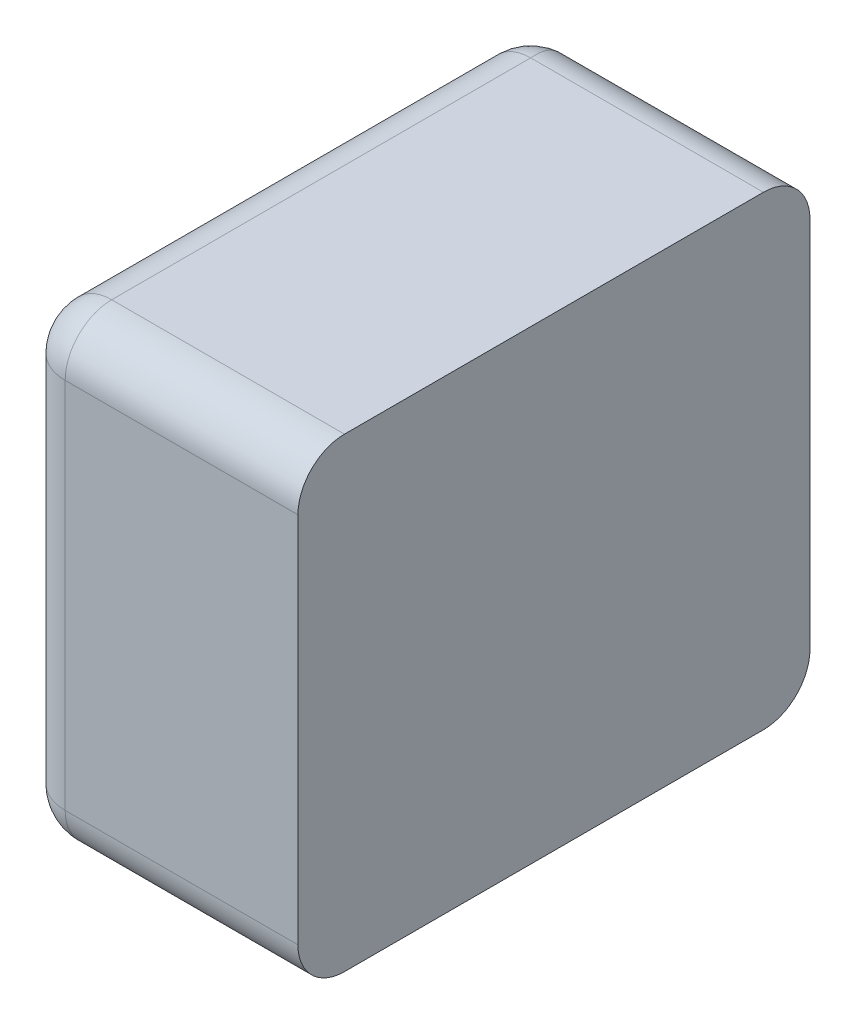
ISO-10303-21;
HEADER;
FILE_DESCRIPTION(('STEP AP214'),'2;1');
FILE_NAME('part.step','',(''),(''),'','','');
FILE_SCHEMA(('AUTOMOTIVE_DESIGN { 1 0 10303 214 1 1 1 1 }'));
ENDSEC;
DATA;
#1=APPLICATION_CONTEXT('core data for automotive mechanical design processes');
#2=APPLICATION_PROTOCOL_DEFINITION('international standard','automotive_design',2000,#1);
#3=PRODUCT_CONTEXT('',#1,'mechanical');
#4=PRODUCT('Part','Part','',(#3));
#5=PRODUCT_RELATED_PRODUCT_CATEGORY('part','',(#4));
#6=PRODUCT_DEFINITION_FORMATION('','',#4);
#7=PRODUCT_DEFINITION_CONTEXT('part definition',#1,'design');
#8=PRODUCT_DEFINITION('design','',#6,#7);
#9=PRODUCT_DEFINITION_SHAPE('','',#8);
#10=(LENGTH_UNIT() NAMED_UNIT(*) SI_UNIT(.MILLI.,.METRE.));
#11=(NAMED_UNIT(*) PLANE_ANGLE_UNIT() SI_UNIT($,.RADIAN.));
#12=(NAMED_UNIT(*) SI_UNIT($,.STERADIAN.) SOLID_ANGLE_UNIT());
#13=UNCERTAINTY_MEASURE_WITH_UNIT(LENGTH_MEASURE(1.E-05),#10,'distance_accuracy_value','');
#14=(GEOMETRIC_REPRESENTATION_CONTEXT(3) GLOBAL_UNCERTAINTY_ASSIGNED_CONTEXT((#13)) GLOBAL_UNIT_ASSIGNED_CONTEXT((#10,
#11,#12)) REPRESENTATION_CONTEXT('',''));
#15=CARTESIAN_POINT('',(0.,0.,0.));
#16=DIRECTION('',(0.,0.,1.));
#17=DIRECTION('',(1.,0.,0.));
#18=AXIS2_PLACEMENT_3D('',#15,#16,#17);
#19=CARTESIAN_POINT('',(-0.45,0.125,0.5));
#20=DIRECTION('',(0.,-1.,0.));
#21=DIRECTION('',(-0.707106781186548,0.,0.707106781186548));
#22=AXIS2_PLACEMENT_3D('',#19,#20,#21);
#23=CYLINDRICAL_SURFACE('',#22,0.05);
#24=CARTESIAN_POINT('',(-0.45,0.2,0.5));
#25=DIRECTION('',(0.,-1.,0.));
#26=DIRECTION('',(0.,0.,1.));
#27=AXIS2_PLACEMENT_3D('',#24,#25,#26);
#28=CIRCLE('',#27,0.05);
#29=CARTESIAN_POINT('',(-0.45,0.2,0.55));
#30=VERTEX_POINT('',#29);
#31=CARTESIAN_POINT('',(-0.5,0.2,0.5));
#32=VERTEX_POINT('',#31);
#33=EDGE_CURVE('E11',#30,#32,#28,.T.);
#34=ORIENTED_EDGE('',*,*,#33,.T.);
#35=DIRECTION('',(0.,-1.,0.));
#36=VECTOR('',#35,1.);
#37=CARTESIAN_POINT('',(-0.5,0.125,0.5));
#38=LINE('',#37,#36);
#39=CARTESIAN_POINT('',(-0.5,-0.2,0.5));
#40=VERTEX_POINT('',#39);
#41=EDGE_CURVE('E24',#32,#40,#38,.T.);
#42=ORIENTED_EDGE('',*,*,#41,.T.);
#43=CARTESIAN_POINT('',(-0.45,-0.2,0.5));
#44=DIRECTION('',(0.,1.,0.));
#45=DIRECTION('',(-1.,0.,0.));
#46=AXIS2_PLACEMENT_3D('',#43,#44,#45);
#47=CIRCLE('',#46,0.05);
#48=CARTESIAN_POINT('',(-0.45,-0.2,0.55));
#49=VERTEX_POINT('',#48);
#50=EDGE_CURVE('E273',#40,#49,#47,.T.);
#51=ORIENTED_EDGE('',*,*,#50,.T.);
#52=DIRECTION('',(0.,1.,0.));
#53=VECTOR('',#52,1.);
#54=CARTESIAN_POINT('',(-0.45,0.125,0.55));
#55=LINE('',#54,#53);
#56=EDGE_CURVE('E271',#49,#30,#55,.T.);
#57=ORIENTED_EDGE('',*,*,#56,.T.);
#58=EDGE_LOOP('',(#34,#42,#51,#57));
#59=FACE_BOUND('',#58,.T.);
#60=ADVANCED_FACE('F17',(#59),#23,.T.);
#61=CARTESIAN_POINT('',(-0.45,-0.2,0.));
#62=DIRECTION('',(0.,0.,1.));
#63=DIRECTION('',(-0.707106781186548,-0.707106781186548,0.));
#64=AXIS2_PLACEMENT_3D('',#61,#62,#63);
#65=CYLINDRICAL_SURFACE('',#64,0.05);
#66=CARTESIAN_POINT('',(-0.45,-0.2,0.05));
#67=DIRECTION('',(0.,0.,1.));
#68=DIRECTION('',(-1.,0.,0.));
#69=AXIS2_PLACEMENT_3D('',#66,#67,#68);
#70=CIRCLE('',#69,0.05);
#71=CARTESIAN_POINT('',(-0.5,-0.2,0.05));
#72=VERTEX_POINT('',#71);
#73=CARTESIAN_POINT('',(-0.45,-0.25,0.05));
#74=VERTEX_POINT('',#73);
#75=EDGE_CURVE('E269',#72,#74,#70,.T.);
#76=ORIENTED_EDGE('',*,*,#75,.T.);
#77=DIRECTION('',(0.,0.,1.));
#78=VECTOR('',#77,1.);
#79=CARTESIAN_POINT('',(-0.45,-0.25,0.));
#80=LINE('',#79,#78);
#81=CARTESIAN_POINT('',(-0.45,-0.25,0.5));
#82=VERTEX_POINT('',#81);
#83=EDGE_CURVE('E267',#74,#82,#80,.T.);
#84=ORIENTED_EDGE('',*,*,#83,.T.);
#85=CARTESIAN_POINT('',(-0.45,-0.2,0.5));
#86=DIRECTION('',(0.,0.,-1.));
#87=DIRECTION('',(0.,-1.,0.));
#88=AXIS2_PLACEMENT_3D('',#85,#86,#87);
#89=CIRCLE('',#88,0.05);
#90=EDGE_CURVE('E251',#82,#40,#89,.T.);
#91=ORIENTED_EDGE('',*,*,#90,.T.);
#92=DIRECTION('',(0.,0.,-1.));
#93=VECTOR('',#92,1.);
#94=CARTESIAN_POINT('',(-0.5,-0.2,0.));
#95=LINE('',#94,#93);
#96=EDGE_CURVE('E239',#40,#72,#95,.T.);
#97=ORIENTED_EDGE('',*,*,#96,.T.);
#98=EDGE_LOOP('',(#76,#84,#91,#97));
#99=FACE_BOUND('',#98,.T.);
#100=ADVANCED_FACE('F231',(#99),#65,.T.);
#101=CARTESIAN_POINT('',(-0.45,-0.2,0.5));
#102=DIRECTION('',(0.408248290463863,-0.816496580927726,-0.408248290463863));
#103=DIRECTION('',(-0.577350269189625,-0.577350269189626,0.577350269189626));
#104=AXIS2_PLACEMENT_3D('',#101,#102,#103);
#105=SPHERICAL_SURFACE('',#104,0.05);
#106=ORIENTED_EDGE('',*,*,#90,.F.);
#107=CARTESIAN_POINT('',(-0.45,-0.2,0.5));
#108=DIRECTION('',(-1.,0.,0.));
#109=DIRECTION('',(0.,-0.707106781186547,0.707106781186548));
#110=AXIS2_PLACEMENT_3D('',#107,#108,#109);
#111=CIRCLE('',#110,0.05);
#112=EDGE_CURVE('E283',#82,#49,#111,.T.);
#113=ORIENTED_EDGE('',*,*,#112,.T.);
#114=ORIENTED_EDGE('',*,*,#50,.F.);
#115=EDGE_LOOP('',(#106,#113,#114));
#116=FACE_BOUND('',#115,.T.);
#117=ADVANCED_FACE('F227',(#116),#105,.T.);
#118=CARTESIAN_POINT('',(-0.45,0.125,0.05));
#119=DIRECTION('',(0.,-1.,0.));
#120=DIRECTION('',(-0.707106781186548,0.,-0.707106781186547));
#121=AXIS2_PLACEMENT_3D('',#118,#119,#120);
#122=CYLINDRICAL_SURFACE('',#121,0.05);
#123=CARTESIAN_POINT('',(-0.45,0.2,0.05));
#124=DIRECTION('',(0.,-1.,0.));
#125=DIRECTION('',(-1.,0.,0.));
#126=AXIS2_PLACEMENT_3D('',#123,#124,#125);
#127=CIRCLE('',#126,0.05);
#128=CARTESIAN_POINT('',(-0.5,0.2,0.05));
#129=VERTEX_POINT('',#128);
#130=CARTESIAN_POINT('',(-0.45,0.2,0.));
#131=VERTEX_POINT('',#130);
#132=EDGE_CURVE('E286',#129,#131,#127,.T.);
#133=ORIENTED_EDGE('',*,*,#132,.T.);
#134=DIRECTION('',(0.,-1.,0.));
#135=VECTOR('',#134,1.);
#136=CARTESIAN_POINT('',(-0.45,0.125,0.));
#137=LINE('',#136,#135);
#138=CARTESIAN_POINT('',(-0.45,-0.2,0.));
#139=VERTEX_POINT('',#138);
#140=EDGE_CURVE('E301',#131,#139,#137,.T.);
#141=ORIENTED_EDGE('',*,*,#140,.T.);
#142=CARTESIAN_POINT('',(-0.45,-0.2,0.05));
#143=DIRECTION('',(0.,1.,0.));
#144=DIRECTION('',(0.,0.,-1.));
#145=AXIS2_PLACEMENT_3D('',#142,#143,#144);
#146=CIRCLE('',#145,0.05);
#147=EDGE_CURVE('E329',#139,#72,#146,.T.);
#148=ORIENTED_EDGE('',*,*,#147,.T.);
#149=DIRECTION('',(0.,1.,0.));
#150=VECTOR('',#149,1.);
#151=CARTESIAN_POINT('',(-0.5,0.125,0.05));
#152=LINE('',#151,#150);
#153=EDGE_CURVE('E322',#72,#129,#152,.T.);
#154=ORIENTED_EDGE('',*,*,#153,.T.);
#155=EDGE_LOOP('',(#133,#141,#148,#154));
#156=FACE_BOUND('',#155,.T.);
#157=ADVANCED_FACE('F223',(#156),#122,.T.);
#158=CARTESIAN_POINT('',(-0.45,-0.2,0.05));
#159=DIRECTION('',(0.408248290463863,0.408248290463863,-0.816496580927726));
#160=DIRECTION('',(-0.577350269189626,-0.577350269189625,-0.577350269189626));
#161=AXIS2_PLACEMENT_3D('',#158,#159,#160);
#162=SPHERICAL_SURFACE('',#161,0.05);
#163=ORIENTED_EDGE('',*,*,#147,.F.);
#164=CARTESIAN_POINT('',(-0.45,-0.2,0.05));
#165=DIRECTION('',(-1.,0.,0.));
#166=DIRECTION('',(0.,-0.707106781186547,-0.707106781186548));
#167=AXIS2_PLACEMENT_3D('',#164,#165,#166);
#168=CIRCLE('',#167,0.05);
#169=EDGE_CURVE('E297',#139,#74,#168,.T.);
#170=ORIENTED_EDGE('',*,*,#169,.T.);
#171=ORIENTED_EDGE('',*,*,#75,.F.);
#172=EDGE_LOOP('',(#163,#170,#171));
#173=FACE_BOUND('',#172,.T.);
#174=ADVANCED_FACE('F219',(#173),#162,.T.);
#175=CARTESIAN_POINT('',(-0.45,0.2,0.));
#176=DIRECTION('',(0.,0.,1.));
#177=DIRECTION('',(-0.707106781186548,0.707106781186548,0.));
#178=AXIS2_PLACEMENT_3D('',#175,#176,#177);
#179=CYLINDRICAL_SURFACE('',#178,0.05);
#180=CARTESIAN_POINT('',(-0.45,0.2,0.05));
#181=DIRECTION('',(0.,0.,1.));
#182=DIRECTION('',(0.,1.,0.));
#183=AXIS2_PLACEMENT_3D('',#180,#181,#182);
#184=CIRCLE('',#183,0.05);
#185=CARTESIAN_POINT('',(-0.45,0.25,0.05));
#186=VERTEX_POINT('',#185);
#187=EDGE_CURVE('E312',#186,#129,#184,.T.);
#188=ORIENTED_EDGE('',*,*,#187,.T.);
#189=DIRECTION('',(0.,0.,1.));
#190=VECTOR('',#189,1.);
#191=CARTESIAN_POINT('',(-0.5,0.2,0.));
#192=LINE('',#191,#190);
#193=EDGE_CURVE('E308',#129,#32,#192,.T.);
#194=ORIENTED_EDGE('',*,*,#193,.T.);
#195=CARTESIAN_POINT('',(-0.45,0.2,0.5));
#196=DIRECTION('',(0.,0.,-1.));
#197=DIRECTION('',(-1.,0.,0.));
#198=AXIS2_PLACEMENT_3D('',#195,#196,#197);
#199=CIRCLE('',#198,0.05);
#200=CARTESIAN_POINT('',(-0.45,0.25,0.5));
#201=VERTEX_POINT('',#200);
#202=EDGE_CURVE('E205',#32,#201,#199,.T.);
#203=ORIENTED_EDGE('',*,*,#202,.T.);
#204=DIRECTION('',(0.,0.,-1.));
#205=VECTOR('',#204,1.);
#206=CARTESIAN_POINT('',(-0.45,0.25,0.));
#207=LINE('',#206,#205);
#208=EDGE_CURVE('E197',#201,#186,#207,.T.);
#209=ORIENTED_EDGE('',*,*,#208,.T.);
#210=EDGE_LOOP('',(#188,#194,#203,#209));
#211=FACE_BOUND('',#210,.T.);
#212=ADVANCED_FACE('F210',(#211),#179,.T.);
#213=CARTESIAN_POINT('',(-0.45,0.2,0.05));
#214=DIRECTION('',(0.408248290463863,-0.408248290463863,-0.816496580927726));
#215=DIRECTION('',(-0.577350269189626,0.577350269189626,-0.577350269189626));
#216=AXIS2_PLACEMENT_3D('',#213,#214,#215);
#217=SPHERICAL_SURFACE('',#216,0.05);
#218=ORIENTED_EDGE('',*,*,#187,.F.);
#219=CARTESIAN_POINT('',(-0.45,0.25,0.0500000000000001));
#220=CARTESIAN_POINT('',(-0.450056476640882,0.250000020313967,0.0491686475723329));
#221=CARTESIAN_POINT('',(-0.450121168311557,0.249979171317549,0.0483378888751717));
#222=CARTESIAN_POINT('',(-0.450265391195623,0.249895695565037,0.0466759757512485));
#223=CARTESIAN_POINT('',(-0.450344988001439,0.249832880868058,0.0458448364284618));
#224=CARTESIAN_POINT('',(-0.450517234671643,0.249665097579262,0.0441847638939235));
#225=CARTESIAN_POINT('',(-0.450609936033336,0.249559959502558,0.0433558532050473));
#226=CARTESIAN_POINT('',(-0.450806520816706,0.249307372398355,0.0417027833546375));
#227=CARTESIAN_POINT('',(-0.45091044290025,0.249159773963409,0.0408786516427795));
#228=CARTESIAN_POINT('',(-0.451127528752862,0.248822292392348,0.0392376527508478));
#229=CARTESIAN_POINT('',(-0.451240719867609,0.248632281058567,0.0384208155731756));
#230=CARTESIAN_POINT('',(-0.451474344176626,0.248210195281024,0.0367968679832575));
#231=CARTESIAN_POINT('',(-0.451594795122853,0.247978014684369,0.0359897877288635));
#232=CARTESIAN_POINT('',(-0.451840892195575,0.247472005262752,0.0343877588325528));
#233=CARTESIAN_POINT('',(-0.451966548375925,0.247198092814035,0.0335928381568206));
#234=CARTESIAN_POINT('',(-0.452220973549075,0.246609228401466,0.0320174664661125));
#235=CARTESIAN_POINT('',(-0.452349746928956,0.24629421548598,0.0312370389478302));
#236=CARTESIAN_POINT('',(-0.452608300810853,0.24562395131688,0.0296929165821987));
#237=CARTESIAN_POINT('',(-0.452738082163722,0.245268661584212,0.0289292385821268));
#238=CARTESIAN_POINT('',(-0.452996535248399,0.244518835357465,0.0274207951382167));
#239=CARTESIAN_POINT('',(-0.453125206487437,0.244124282319878,0.0266760378338959));
#240=CARTESIAN_POINT('',(-0.453379323912972,0.243297108379355,0.0252075249279587));
#241=CARTESIAN_POINT('',(-0.453504770480528,0.242864492001337,0.0244837668435499));
#242=CARTESIAN_POINT('',(-0.453750336828149,0.241962553597264,0.0230592436005362));
#243=CARTESIAN_POINT('',(-0.453870460068205,0.241493255977843,0.0223584635863285));
#244=CARTESIAN_POINT('',(-0.454103304064891,0.240519495705679,0.0209817830794971));
#245=CARTESIAN_POINT('',(-0.454216033516177,0.240015075848481,0.020305853790615));
#246=CARTESIAN_POINT('',(-0.454432052512974,0.238972784289588,0.0189806505019824));
#247=CARTESIAN_POINT('',(-0.454535358057478,0.238434971990044,0.0183313323972142));
#248=CARTESIAN_POINT('',(-0.454730542154479,0.237327774609329,0.0170610107449638));
#249=CARTESIAN_POINT('',(-0.454822445957708,0.236758463484927,0.0164399466310213));
#250=CARTESIAN_POINT('',(-0.454992901649071,0.235590305843476,0.0152276706097986));
#251=CARTESIAN_POINT('',(-0.455071489829275,0.23499154553938,0.0146363807516999));
#252=CARTESIAN_POINT('',(-0.455213463043959,0.233766676890247,0.0134850647248488));
#253=CARTESIAN_POINT('',(-0.455276897009026,0.233140664496341,0.012924942540811));
#254=CARTESIAN_POINT('',(-0.455386795425953,0.231863619839021,0.011837243218224));
#255=CARTESIAN_POINT('',(-0.455433322818258,0.231212690558093,0.0113095515743238));
#256=CARTESIAN_POINT('',(-0.455507737338678,0.229888271236327,0.0102878612038457));
#257=CARTESIAN_POINT('',(-0.45553570253075,0.229214888348585,0.00979372932103676));
#258=CARTESIAN_POINT('',(-0.455571427793508,0.227848141278855,0.00884017011466115));
#259=CARTESIAN_POINT('',(-0.455579281877824,0.227154885445235,0.00838059109664291));
#260=CARTESIAN_POINT('',(-0.455573335713261,0.225751081087255,0.00749701090952373));
#261=CARTESIAN_POINT('',(-0.455559645939104,0.225040639060477,0.00707283990073674));
#262=CARTESIAN_POINT('',(-0.455509287643763,0.223605248184243,0.0062608091643944));
#263=CARTESIAN_POINT('',(-0.455472746231199,0.222880400913832,0.00587276212999637));
#264=CARTESIAN_POINT('',(-0.455375493621831,0.221419070457526,0.00513357207398296));
#265=CARTESIAN_POINT('',(-0.455314925981526,0.220682680895238,0.00478222524352162));
#266=CARTESIAN_POINT('',(-0.455168570932992,0.219201208347948,0.00411688728920321));
#267=CARTESIAN_POINT('',(-0.455082942970717,0.218456208087868,0.00380267710656442));
#268=CARTESIAN_POINT('',(-0.454885566112575,0.216960517038454,0.00321192384506902));
#269=CARTESIAN_POINT('',(-0.454773991607376,0.216209895271862,0.00293514798912296));
#270=CARTESIAN_POINT('',(-0.454523973299393,0.214706002926951,0.00241943417305823));
#271=CARTESIAN_POINT('',(-0.454385717519098,0.213952785138196,0.00218025153084975));
#272=CARTESIAN_POINT('',(-0.454081755398417,0.212446796385434,0.00173976080825311));
#273=CARTESIAN_POINT('',(-0.453916248962334,0.211694059537445,0.00153819817979118));
#274=CARTESIAN_POINT('',(-0.453557343726359,0.210192060427522,0.00117283430568305));
#275=CARTESIAN_POINT('',(-0.453364154831346,0.209442812292273,0.00100877105149765));
#276=CARTESIAN_POINT('',(-0.453052732369609,0.208321945507501,0.000790441264630339));
#277=CARTESIAN_POINT('',(-0.452945638881777,0.207949832604319,0.000722439845056718));
#278=CARTESIAN_POINT('',(-0.452724431166697,0.207207637428366,0.000595741109099705));
#279=CARTESIAN_POINT('',(-0.452610344441124,0.206837552741953,0.000537010232220855));
#280=CARTESIAN_POINT('',(-0.452375149481327,0.206099812695661,0.000428806639232069));
#281=CARTESIAN_POINT('',(-0.452254068989278,0.205732153421865,0.00037930024688638));
#282=CARTESIAN_POINT('',(-0.452004892004011,0.204999641822439,0.000289487013903615));
#283=CARTESIAN_POINT('',(-0.451876823418455,0.204634784141684,0.000249146488184946));
#284=CARTESIAN_POINT('',(-0.45161368768569,0.203908256305697,0.000177600103776418));
#285=CARTESIAN_POINT('',(-0.451478648512781,0.203546579332125,0.0001463606364773));
#286=CARTESIAN_POINT('',(-0.451201599789781,0.20282678964261,9.2943500749361E-05));
#287=CARTESIAN_POINT('',(-0.451059618183824,0.202468668656838,7.07323935902586E-05));
#288=CARTESIAN_POINT('',(-0.450768722771826,0.201756364451594,3.52924790904308E-05));
#289=CARTESIAN_POINT('',(-0.450619836783965,0.201402171529021,2.20304925721484E-05));
#290=CARTESIAN_POINT('',(-0.450315184973883,0.200698095332166,4.39992448218605E-06));
#291=CARTESIAN_POINT('',(-0.45015944673132,0.200348200942932,-1.47590172806037E-09));
#292=CARTESIAN_POINT('',(-0.45,0.2,0.));
#293=B_SPLINE_CURVE_WITH_KNOTS('',3,(#219,#220,#221,#222,#223,#224,#225,#226,#227,#228,#229,
#230,#231,#232,#233,#234,#235,#236,#237,#238,#239,#240,#241,#242,#243,#244,#245,#246,#247,#248,
#249,#250,#251,#252,#253,#254,#255,#256,#257,#258,#259,#260,#261,#262,#263,#264,#265,#266,#267,
#268,#269,#270,#271,#272,#273,#274,#275,#276,#277,#278,#279,#280,#281,#282,#283,#284,#285,#286,
#287,#288,#289,#290,#291,#292),.UNSPECIFIED.,.F.,.F.,(4,2,2,2,2,2,2,2,2,2,2,2,2,2,2,2,2,2,2,2,2,
2,2,2,2,2,2,2,2,2,2,2,2,2,2,2,4),(0.,0.00249945349828856,0.00501017636236175,
0.00753105510997416,0.0100609150362242,0.0125985278601289,0.015142619470862,0.017691877752768,
0.020244960471291,0.0228005032044077,0.0253571273060391,0.0279134478892867,0.0304680818182009,
0.0330196556971653,0.0355668138468768,0.0381082262553105,0.0406425964909795,0.0431686695642027,
0.0456852397199664,0.048191158143267,0.0506853405545279,0.0531667746687543,0.0556345274875088,
0.0580877523875284,0.0605256959638785,0.0629477045789643,0.0653532305615733,0.0677418379925143,
0.0701132080055177,0.0712924926926685,0.0724674051483096,0.0736379404537152,0.0748041017706804,
0.0759659004268235,0.0771233559869031,0.0782764963093342,0.0794253575870824),.UNSPECIFIED.);
#294=EDGE_CURVE('E157',#186,#131,#293,.T.);
#295=ORIENTED_EDGE('',*,*,#294,.T.);
#296=ORIENTED_EDGE('',*,*,#132,.F.);
#297=EDGE_LOOP('',(#218,#295,#296));
#298=FACE_BOUND('',#297,.T.);
#299=ADVANCED_FACE('F189',(#298),#217,.T.);
#300=CARTESIAN_POINT('',(-0.45,0.2,0.5));
#301=DIRECTION('',(-0.408248290463863,-0.816496580927727,0.408248290463862));
#302=DIRECTION('',(-0.577350269189626,0.577350269189625,0.577350269189627));
#303=AXIS2_PLACEMENT_3D('',#300,#301,#302);
#304=SPHERICAL_SURFACE('',#303,0.05);
#305=ORIENTED_EDGE('',*,*,#33,.F.);
#306=CARTESIAN_POINT('',(-0.45,0.2,0.5));
#307=DIRECTION('',(-1.,0.,0.));
#308=DIRECTION('',(0.,0.707106781186547,0.707106781186548));
#309=AXIS2_PLACEMENT_3D('',#306,#307,#308);
#310=CIRCLE('',#309,0.05);
#311=EDGE_CURVE('E96',#30,#201,#310,.T.);
#312=ORIENTED_EDGE('',*,*,#311,.T.);
#313=ORIENTED_EDGE('',*,*,#202,.F.);
#314=EDGE_LOOP('',(#305,#312,#313));
#315=FACE_BOUND('',#314,.T.);
#316=ADVANCED_FACE('F184',(#315),#304,.T.);
#317=CARTESIAN_POINT('',(-0.425,-0.2,0.05));
#318=DIRECTION('',(1.,0.,0.));
#319=DIRECTION('',(0.,-0.707106781186547,-0.707106781186548));
#320=AXIS2_PLACEMENT_3D('',#317,#318,#319);
#321=CYLINDRICAL_SURFACE('',#320,0.05);
#322=ORIENTED_EDGE('',*,*,#169,.F.);
#323=DIRECTION('',(1.,0.,0.));
#324=VECTOR('',#323,1.);
#325=CARTESIAN_POINT('',(-0.425,-0.2,0.));
#326=LINE('',#325,#324);
#327=CARTESIAN_POINT('',(-0.2,-0.2,0.));
#328=VERTEX_POINT('',#327);
#329=EDGE_CURVE('E152',#139,#328,#326,.T.);
#330=ORIENTED_EDGE('',*,*,#329,.T.);
#331=CARTESIAN_POINT('',(-0.2,-0.2,0.05));
#332=DIRECTION('',(-1.,0.,0.));
#333=DIRECTION('',(0.,-0.707106781186547,-0.707106781186548));
#334=AXIS2_PLACEMENT_3D('',#331,#332,#333);
#335=CIRCLE('',#334,0.05);
#336=CARTESIAN_POINT('',(-0.2,-0.25,0.05));
#337=VERTEX_POINT('',#336);
#338=EDGE_CURVE('E150',#328,#337,#335,.T.);
#339=ORIENTED_EDGE('',*,*,#338,.T.);
#340=DIRECTION('',(-1.,0.,0.));
#341=VECTOR('',#340,1.);
#342=CARTESIAN_POINT('',(-0.425,-0.25,0.05));
#343=LINE('',#342,#341);
#344=EDGE_CURVE('E147',#337,#74,#343,.T.);
#345=ORIENTED_EDGE('',*,*,#344,.T.);
#346=EDGE_LOOP('',(#322,#330,#339,#345));
#347=FACE_BOUND('',#346,.T.);
#348=ADVANCED_FACE('F180',(#347),#321,.T.);
#349=CARTESIAN_POINT('',(-0.35,0.,0.));
#350=DIRECTION('',(0.,0.,1.));
#351=DIRECTION('',(1.,0.,0.));
#352=AXIS2_PLACEMENT_3D('',#349,#350,#351);
#353=PLANE('',#352);
#354=ORIENTED_EDGE('',*,*,#140,.F.);
#355=DIRECTION('',(-1.,0.,0.));
#356=VECTOR('',#355,1.);
#357=CARTESIAN_POINT('',(-0.275,0.2,0.));
#358=LINE('',#357,#356);
#359=CARTESIAN_POINT('',(-0.2,0.2,0.));
#360=VERTEX_POINT('',#359);
#361=EDGE_CURVE('E142',#360,#131,#358,.T.);
#362=ORIENTED_EDGE('',*,*,#361,.F.);
#363=DIRECTION('',(0.,1.,0.));
#364=VECTOR('',#363,1.);
#365=CARTESIAN_POINT('',(-0.2,-0.25,0.));
#366=LINE('',#365,#364);
#367=EDGE_CURVE('E139',#328,#360,#366,.T.);
#368=ORIENTED_EDGE('',*,*,#367,.F.);
#369=ORIENTED_EDGE('',*,*,#329,.F.);
#370=EDGE_LOOP('',(#354,#362,#368,#369));
#371=FACE_BOUND('',#370,.T.);
#372=ADVANCED_FACE('F175',(#371),#353,.F.);
#373=CARTESIAN_POINT('',(-0.275,0.2,0.05));
#374=DIRECTION('',(-1.,0.,0.));
#375=DIRECTION('',(0.,0.707106781186547,-0.707106781186548));
#376=AXIS2_PLACEMENT_3D('',#373,#374,#375);
#377=CYLINDRICAL_SURFACE('',#376,0.05);
#378=ORIENTED_EDGE('',*,*,#294,.F.);
#379=DIRECTION('',(1.,0.,0.));
#380=VECTOR('',#379,1.);
#381=CARTESIAN_POINT('',(-0.275,0.25,0.05));
#382=LINE('',#381,#380);
#383=CARTESIAN_POINT('',(-0.2,0.25,0.05));
#384=VERTEX_POINT('',#383);
#385=EDGE_CURVE('E135',#186,#384,#382,.T.);
#386=ORIENTED_EDGE('',*,*,#385,.T.);
#387=CARTESIAN_POINT('',(-0.2,0.2,0.05));
#388=DIRECTION('',(-1.,0.,0.));
#389=DIRECTION('',(0.,0.707106781186547,-0.707106781186548));
#390=AXIS2_PLACEMENT_3D('',#387,#388,#389);
#391=CIRCLE('',#390,0.05);
#392=EDGE_CURVE('E132',#384,#360,#391,.T.);
#393=ORIENTED_EDGE('',*,*,#392,.T.);
#394=ORIENTED_EDGE('',*,*,#361,.T.);
#395=EDGE_LOOP('',(#378,#386,#393,#394));
#396=FACE_BOUND('',#395,.T.);
#397=ADVANCED_FACE('F164',(#396),#377,.T.);
#398=CARTESIAN_POINT('',(-0.2,0.25,0.));
#399=DIRECTION('',(0.,1.,0.));
#400=DIRECTION('',(-1.,0.,0.));
#401=AXIS2_PLACEMENT_3D('',#398,#399,#400);
#402=PLANE('',#401);
#403=ORIENTED_EDGE('',*,*,#208,.F.);
#404=DIRECTION('',(-1.,0.,0.));
#405=VECTOR('',#404,1.);
#406=CARTESIAN_POINT('',(-0.275,0.25,0.5));
#407=LINE('',#406,#405);
#408=CARTESIAN_POINT('',(-0.2,0.25,0.5));
#409=VERTEX_POINT('',#408);
#410=EDGE_CURVE('E128',#409,#201,#407,.T.);
#411=ORIENTED_EDGE('',*,*,#410,.F.);
#412=DIRECTION('',(0.,0.,1.));
#413=VECTOR('',#412,1.);
#414=CARTESIAN_POINT('',(-0.2,0.25,0.));
#415=LINE('',#414,#413);
#416=EDGE_CURVE('E110',#384,#409,#415,.T.);
#417=ORIENTED_EDGE('',*,*,#416,.F.);
#418=ORIENTED_EDGE('',*,*,#385,.F.);
#419=EDGE_LOOP('',(#403,#411,#417,#418));
#420=FACE_BOUND('',#419,.T.);
#421=ADVANCED_FACE('F174',(#420),#402,.T.);
#422=CARTESIAN_POINT('',(-0.5,0.25,0.));
#423=DIRECTION('',(-1.,0.,0.));
#424=DIRECTION('',(0.,-1.,0.));
#425=AXIS2_PLACEMENT_3D('',#422,#423,#424);
#426=PLANE('',#425);
#427=ORIENTED_EDGE('',*,*,#41,.F.);
#428=ORIENTED_EDGE('',*,*,#193,.F.);
#429=ORIENTED_EDGE('',*,*,#153,.F.);
#430=ORIENTED_EDGE('',*,*,#96,.F.);
#431=EDGE_LOOP('',(#427,#428,#429,#430));
#432=FACE_BOUND('',#431,.T.);
#433=ADVANCED_FACE('F342',(#432),#426,.T.);
#434=CARTESIAN_POINT('',(-0.425,-0.2,0.5));
#435=DIRECTION('',(1.,0.,0.));
#436=DIRECTION('',(0.,-0.707106781186547,0.707106781186548));
#437=AXIS2_PLACEMENT_3D('',#434,#435,#436);
#438=CYLINDRICAL_SURFACE('',#437,0.05);
#439=ORIENTED_EDGE('',*,*,#112,.F.);
#440=DIRECTION('',(1.,0.,0.));
#441=VECTOR('',#440,1.);
#442=CARTESIAN_POINT('',(-0.425,-0.25,0.5));
#443=LINE('',#442,#441);
#444=CARTESIAN_POINT('',(-0.2,-0.25,0.5));
#445=VERTEX_POINT('',#444);
#446=EDGE_CURVE('E123',#82,#445,#443,.T.);
#447=ORIENTED_EDGE('',*,*,#446,.T.);
#448=CARTESIAN_POINT('',(-0.2,-0.2,0.5));
#449=DIRECTION('',(-1.,0.,0.));
#450=DIRECTION('',(0.,-0.707106781186547,0.707106781186548));
#451=AXIS2_PLACEMENT_3D('',#448,#449,#450);
#452=CIRCLE('',#451,0.05);
#453=CARTESIAN_POINT('',(-0.2,-0.2,0.55));
#454=VERTEX_POINT('',#453);
#455=EDGE_CURVE('E121',#445,#454,#452,.T.);
#456=ORIENTED_EDGE('',*,*,#455,.T.);
#457=DIRECTION('',(-1.,0.,0.));
#458=VECTOR('',#457,1.);
#459=CARTESIAN_POINT('',(-0.425,-0.2,0.55));
#460=LINE('',#459,#458);
#461=EDGE_CURVE('E115',#454,#49,#460,.T.);
#462=ORIENTED_EDGE('',*,*,#461,.T.);
#463=EDGE_LOOP('',(#439,#447,#456,#462));
#464=FACE_BOUND('',#463,.T.);
#465=ADVANCED_FACE('F288',(#464),#438,.T.);
#466=CARTESIAN_POINT('',(-0.5,-0.25,0.));
#467=DIRECTION('',(0.,-1.,0.));
#468=DIRECTION('',(1.,0.,0.));
#469=AXIS2_PLACEMENT_3D('',#466,#467,#468);
#470=PLANE('',#469);
#471=ORIENTED_EDGE('',*,*,#83,.F.);
#472=ORIENTED_EDGE('',*,*,#344,.F.);
#473=DIRECTION('',(0.,0.,1.));
#474=VECTOR('',#473,1.);
#475=CARTESIAN_POINT('',(-0.2,-0.25,0.));
#476=LINE('',#475,#474);
#477=EDGE_CURVE('E100',#337,#445,#476,.T.);
#478=ORIENTED_EDGE('',*,*,#477,.T.);
#479=ORIENTED_EDGE('',*,*,#446,.F.);
#480=EDGE_LOOP('',(#471,#472,#478,#479));
#481=FACE_BOUND('',#480,.T.);
#482=ADVANCED_FACE('F294',(#481),#470,.T.);
#483=CARTESIAN_POINT('',(-0.275,0.2,0.5));
#484=DIRECTION('',(-1.,0.,0.));
#485=DIRECTION('',(0.,0.707106781186547,0.707106781186548));
#486=AXIS2_PLACEMENT_3D('',#483,#484,#485);
#487=CYLINDRICAL_SURFACE('',#486,0.05);
#488=ORIENTED_EDGE('',*,*,#311,.F.);
#489=DIRECTION('',(1.,0.,0.));
#490=VECTOR('',#489,1.);
#491=CARTESIAN_POINT('',(-0.275,0.2,0.55));
#492=LINE('',#491,#490);
#493=CARTESIAN_POINT('',(-0.2,0.2,0.55));
#494=VERTEX_POINT('',#493);
#495=EDGE_CURVE('E91',#30,#494,#492,.T.);
#496=ORIENTED_EDGE('',*,*,#495,.T.);
#497=CARTESIAN_POINT('',(-0.2,0.2,0.5));
#498=DIRECTION('',(-1.,0.,0.));
#499=DIRECTION('',(0.,0.707106781186547,0.707106781186548));
#500=AXIS2_PLACEMENT_3D('',#497,#498,#499);
#501=CIRCLE('',#500,0.05);
#502=EDGE_CURVE('E95',#494,#409,#501,.T.);
#503=ORIENTED_EDGE('',*,*,#502,.T.);
#504=ORIENTED_EDGE('',*,*,#410,.T.);
#505=EDGE_LOOP('',(#488,#496,#503,#504));
#506=FACE_BOUND('',#505,.T.);
#507=ADVANCED_FACE('F93',(#506),#487,.T.);
#508=CARTESIAN_POINT('',(-0.2,-0.25,0.));
#509=DIRECTION('',(1.,0.,0.));
#510=DIRECTION('',(0.,1.,0.));
#511=AXIS2_PLACEMENT_3D('',#508,#509,#510);
#512=PLANE('',#511);
#513=ORIENTED_EDGE('',*,*,#455,.F.);
#514=ORIENTED_EDGE('',*,*,#477,.F.);
#515=ORIENTED_EDGE('',*,*,#338,.F.);
#516=ORIENTED_EDGE('',*,*,#367,.T.);
#517=ORIENTED_EDGE('',*,*,#392,.F.);
#518=ORIENTED_EDGE('',*,*,#416,.T.);
#519=ORIENTED_EDGE('',*,*,#502,.F.);
#520=DIRECTION('',(0.,1.,0.));
#521=VECTOR('',#520,1.);
#522=CARTESIAN_POINT('',(-0.2,-0.25,0.55));
#523=LINE('',#522,#521);
#524=EDGE_CURVE('E107',#454,#494,#523,.T.);
#525=ORIENTED_EDGE('',*,*,#524,.F.);
#526=EDGE_LOOP('',(#513,#514,#515,#516,#517,#518,#519,#525));
#527=FACE_BOUND('',#526,.T.);
#528=ADVANCED_FACE('F106',(#527),#512,.T.);
#529=CARTESIAN_POINT('',(-0.35,0.,0.55));
#530=DIRECTION('',(0.,0.,1.));
#531=DIRECTION('',(1.,0.,0.));
#532=AXIS2_PLACEMENT_3D('',#529,#530,#531);
#533=PLANE('',#532);
#534=ORIENTED_EDGE('',*,*,#56,.F.);
#535=ORIENTED_EDGE('',*,*,#461,.F.);
#536=ORIENTED_EDGE('',*,*,#524,.T.);
#537=ORIENTED_EDGE('',*,*,#495,.F.);
#538=EDGE_LOOP('',(#534,#535,#536,#537));
#539=FACE_BOUND('',#538,.T.);
#540=ADVANCED_FACE('F113',(#539),#533,.T.);
#541=CLOSED_SHELL('',(#60,#100,#117,#157,#174,#212,#299,#316,#348,#372,#397,#421,#433,#465,#482,
#507,#528,#540));
#542=MANIFOLD_SOLID_BREP('B1',#541);
#543=ADVANCED_BREP_SHAPE_REPRESENTATION('',(#18,#542),#14);
#544=SHAPE_DEFINITION_REPRESENTATION(#9,#543);
ENDSEC;
END-ISO-10303-21;
